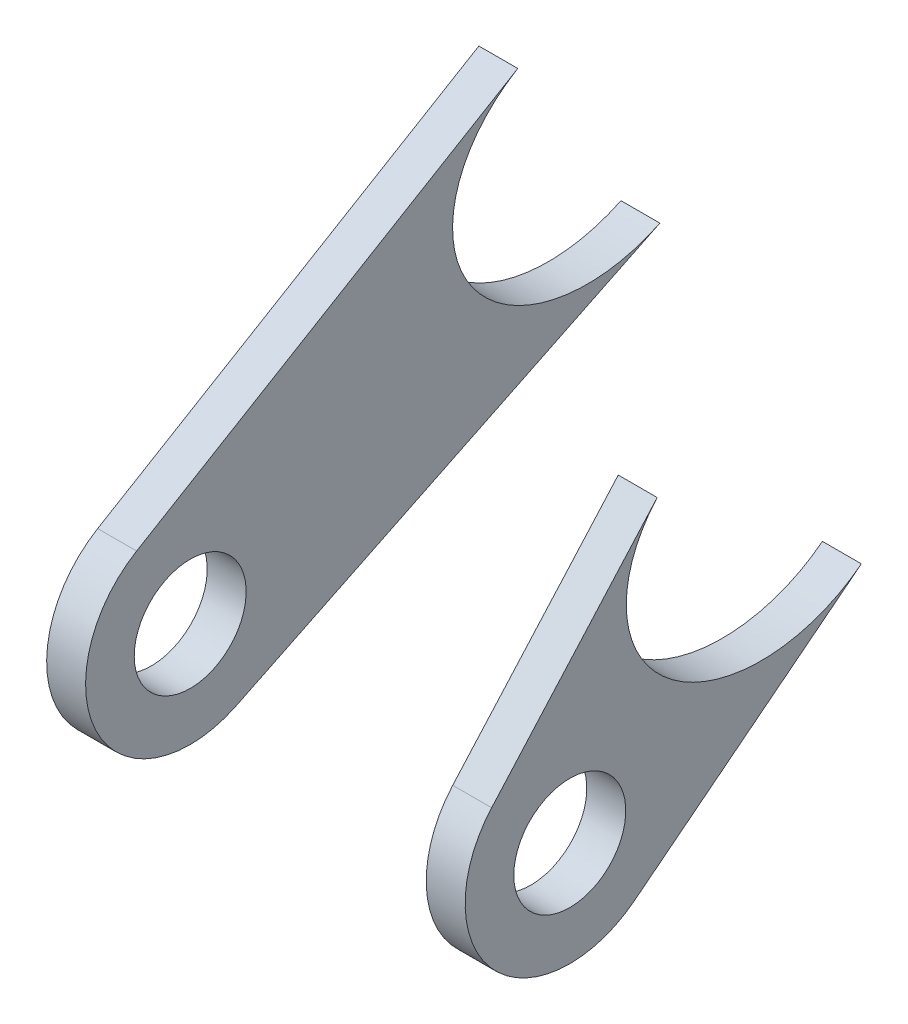
ISO-10303-21;
HEADER;
FILE_DESCRIPTION(('STEP AP214'),'2;1');
FILE_NAME('part.step','',(''),(''),'','','');
FILE_SCHEMA(('AUTOMOTIVE_DESIGN { 1 0 10303 214 1 1 1 1 }'));
ENDSEC;
DATA;
#1=APPLICATION_CONTEXT('core data for automotive mechanical design processes');
#2=APPLICATION_PROTOCOL_DEFINITION('international standard','automotive_design',2000,#1);
#3=PRODUCT_CONTEXT('',#1,'mechanical');
#4=PRODUCT('Part','Part','',(#3));
#5=PRODUCT_RELATED_PRODUCT_CATEGORY('part','',(#4));
#6=PRODUCT_DEFINITION_FORMATION('','',#4);
#7=PRODUCT_DEFINITION_CONTEXT('part definition',#1,'design');
#8=PRODUCT_DEFINITION('design','',#6,#7);
#9=PRODUCT_DEFINITION_SHAPE('','',#8);
#10=(LENGTH_UNIT() NAMED_UNIT(*) SI_UNIT(.MILLI.,.METRE.));
#11=(NAMED_UNIT(*) PLANE_ANGLE_UNIT() SI_UNIT($,.RADIAN.));
#12=(NAMED_UNIT(*) SI_UNIT($,.STERADIAN.) SOLID_ANGLE_UNIT());
#13=UNCERTAINTY_MEASURE_WITH_UNIT(LENGTH_MEASURE(1.E-05),#10,'distance_accuracy_value','');
#14=(GEOMETRIC_REPRESENTATION_CONTEXT(3) GLOBAL_UNCERTAINTY_ASSIGNED_CONTEXT((#13)) GLOBAL_UNIT_ASSIGNED_CONTEXT((#10,
#11,#12)) REPRESENTATION_CONTEXT('',''));
#15=CARTESIAN_POINT('',(0.,0.,0.));
#16=DIRECTION('',(0.,0.,1.));
#17=DIRECTION('',(1.,0.,0.));
#18=AXIS2_PLACEMENT_3D('',#15,#16,#17);
#19=CARTESIAN_POINT('',(10.3146290873709,143.374441874379,161.006531885884));
#20=DIRECTION('',(-1.57760826096266E-08,0.665030851347808,0.746815885446747));
#21=DIRECTION('',(0.,-0.746815885446747,0.665030851347808));
#22=AXIS2_PLACEMENT_3D('',#19,#20,#21);
#23=PLANE('',#22);
#24=DIRECTION('',(2.07258740079389E-08,0.746815885446748,-0.665030851347808));
#25=VECTOR('',#24,1.);
#26=CARTESIAN_POINT('',(6.31462908737091,143.374441894326,161.006531783623));
#27=LINE('',#26,#25);
#28=CARTESIAN_POINT('',(6.31461785346862,-261.417012490151,521.468609215989));
#29=VERTEX_POINT('',#28);
#30=CARTESIAN_POINT('',(6.31461838357811,-242.315565556028,504.458993105619));
#31=VERTEX_POINT('',#30);
#32=EDGE_CURVE('E127',#29,#31,#27,.T.);
#33=ORIENTED_EDGE('',*,*,#32,.F.);
#34=DIRECTION('',(-1.,4.98683030140527E-09,-2.55651747405935E-08));
#35=VECTOR('',#34,1.);
#36=CARTESIAN_POINT('',(10.3146178534686,-261.417012510098,521.468609318249));
#37=LINE('',#36,#35);
#38=CARTESIAN_POINT('',(10.3146178534686,-261.417012510098,521.468609318249));
#39=VERTEX_POINT('',#38);
#40=EDGE_CURVE('E12',#39,#29,#37,.T.);
#41=ORIENTED_EDGE('',*,*,#40,.F.);
#42=DIRECTION('',(2.07258740079389E-08,0.746815885446748,-0.665030851347808));
#43=VECTOR('',#42,1.);
#44=CARTESIAN_POINT('',(10.3146290873709,143.374441874379,161.006531885884));
#45=LINE('',#44,#43);
#46=CARTESIAN_POINT('',(10.3146183835781,-242.315565575976,504.45899320788));
#47=VERTEX_POINT('',#46);
#48=EDGE_CURVE('E105',#39,#47,#45,.T.);
#49=ORIENTED_EDGE('',*,*,#48,.T.);
#50=DIRECTION('',(-1.,4.98683030140527E-09,-2.55651747405935E-08));
#51=VECTOR('',#50,1.);
#52=CARTESIAN_POINT('',(10.3146183835781,-242.315565575976,504.45899320788));
#53=LINE('',#52,#51);
#54=EDGE_CURVE('E50',#47,#31,#53,.T.);
#55=ORIENTED_EDGE('',*,*,#54,.T.);
#56=EDGE_LOOP('',(#33,#41,#49,#55));
#57=FACE_BOUND('',#56,.T.);
#58=ADVANCED_FACE('F46',(#57),#23,.T.);
#59=CARTESIAN_POINT('',(10.3146180230615,-268.566094162037,513.440338549652));
#60=DIRECTION('',(-1.,4.98683030140527E-09,-2.55651747405935E-08));
#61=DIRECTION('',(-2.55651747405935E-08,0.,1.));
#62=AXIS2_PLACEMENT_3D('',#59,#60,#61);
#63=CYLINDRICAL_SURFACE('',#62,10.7499999999999);
#64=CARTESIAN_POINT('',(6.31461802306151,-268.56609414209,513.440338447392));
#65=DIRECTION('',(-1.,4.98683030433046E-09,-2.55651747346469E-08));
#66=DIRECTION('',(-2.55651747346469E-08,0.,1.));
#67=AXIS2_PLACEMENT_3D('',#64,#65,#66);
#68=CIRCLE('',#67,10.7499999999999);
#69=CARTESIAN_POINT('',(6.31461815066465,-277.019995954462,506.800003806218));
#70=VERTEX_POINT('',#69);
#71=EDGE_CURVE('E133',#70,#29,#68,.T.);
#72=ORIENTED_EDGE('',*,*,#71,.F.);
#73=DIRECTION('',(-1.,4.98683030140527E-09,-2.55651747405935E-08));
#74=VECTOR('',#73,1.);
#75=CARTESIAN_POINT('',(10.3146181506647,-277.019995974409,506.800003908478));
#76=LINE('',#75,#74);
#77=CARTESIAN_POINT('',(10.3146181506647,-277.019995974409,506.800003908478));
#78=VERTEX_POINT('',#77);
#79=EDGE_CURVE('E56',#78,#70,#76,.T.);
#80=ORIENTED_EDGE('',*,*,#79,.F.);
#81=CARTESIAN_POINT('',(10.3146180230615,-268.566094162037,513.440338549652));
#82=DIRECTION('',(-1.,4.98683030433046E-09,-2.55651747346469E-08));
#83=DIRECTION('',(-2.55651747346469E-08,0.,1.));
#84=AXIS2_PLACEMENT_3D('',#81,#82,#83);
#85=CIRCLE('',#84,10.7499999999999);
#86=EDGE_CURVE('E98',#78,#39,#85,.T.);
#87=ORIENTED_EDGE('',*,*,#86,.T.);
#88=ORIENTED_EDGE('',*,*,#40,.T.);
#89=EDGE_LOOP('',(#72,#80,#87,#88));
#90=FACE_BOUND('',#89,.T.);
#91=ADVANCED_FACE('F122',(#90),#63,.T.);
#92=CARTESIAN_POINT('',(10.3146313584933,74.867774510086,58.8068196464193));
#93=DIRECTION('',(-1.18700596950814E-08,0.786409470899636,0.617705548039965));
#94=DIRECTION('',(0.,-0.617705548039965,0.786409470899636));
#95=AXIS2_PLACEMENT_3D('',#92,#93,#94);
#96=PLANE('',#95);
#97=DIRECTION('',(2.31850882826492E-08,0.617705548039965,-0.786409470899636));
#98=VECTOR('',#97,1.);
#99=CARTESIAN_POINT('',(6.31463135849329,74.8677745300334,58.8068195441586));
#100=LINE('',#99,#98);
#101=CARTESIAN_POINT('',(6.31461883810034,-258.705084692557,483.483037136984));
#102=VERTEX_POINT('',#101);
#103=EDGE_CURVE('E102',#70,#102,#100,.T.);
#104=ORIENTED_EDGE('',*,*,#103,.T.);
#105=DIRECTION('',(-1.,4.98683030140527E-09,-2.55651747405935E-08));
#106=VECTOR('',#105,1.);
#107=CARTESIAN_POINT('',(10.3146188381003,-258.705084712504,483.483037239244));
#108=LINE('',#107,#106);
#109=CARTESIAN_POINT('',(10.3146188381003,-258.705084712504,483.483037239244));
#110=VERTEX_POINT('',#109);
#111=EDGE_CURVE('E100',#110,#102,#108,.T.);
#112=ORIENTED_EDGE('',*,*,#111,.F.);
#113=DIRECTION('',(2.31850882826492E-08,0.617705548039965,-0.786409470899636));
#114=VECTOR('',#113,1.);
#115=CARTESIAN_POINT('',(10.3146313584933,74.867774510086,58.8068196464193));
#116=LINE('',#115,#114);
#117=EDGE_CURVE('E94',#78,#110,#116,.T.);
#118=ORIENTED_EDGE('',*,*,#117,.F.);
#119=ORIENTED_EDGE('',*,*,#79,.T.);
#120=EDGE_LOOP('',(#104,#112,#118,#119));
#121=FACE_BOUND('',#120,.T.);
#122=ADVANCED_FACE('F101',(#121),#96,.F.);
#123=CARTESIAN_POINT('',(10.3146180230615,-268.566094162037,513.440338549652));
#124=DIRECTION('',(-1.,4.98683030140527E-09,-2.55651747405935E-08));
#125=DIRECTION('',(-2.55651747405935E-08,0.,1.));
#126=AXIS2_PLACEMENT_3D('',#123,#124,#125);
#127=CYLINDRICAL_SURFACE('',#126,5.75000000000009);
#128=CARTESIAN_POINT('',(10.3146180230615,-268.566094162037,513.440338549652));
#129=DIRECTION('',(-1.,4.98683030433046E-09,-2.55651747346469E-08));
#130=DIRECTION('',(-2.55651747346469E-08,0.,1.));
#131=AXIS2_PLACEMENT_3D('',#128,#129,#130);
#132=CIRCLE('',#131,5.75000000000009);
#133=CARTESIAN_POINT('',(10.3146178760618,-268.566094162037,519.190338549652));
#134=VERTEX_POINT('',#133);
#135=EDGE_CURVE('E107',#134,#134,#132,.T.);
#136=ORIENTED_EDGE('',*,*,#135,.F.);
#137=EDGE_LOOP('',(#136));
#138=FACE_BOUND('',#137,.T.);
#139=CARTESIAN_POINT('',(6.31461802306151,-268.56609414209,513.440338447392));
#140=DIRECTION('',(-1.,4.98683030433046E-09,-2.55651747346469E-08));
#141=DIRECTION('',(-2.55651747346469E-08,0.,1.));
#142=AXIS2_PLACEMENT_3D('',#139,#140,#141);
#143=CIRCLE('',#142,5.75000000000009);
#144=CARTESIAN_POINT('',(6.31461787606176,-268.56609414209,519.190338447392));
#145=VERTEX_POINT('',#144);
#146=EDGE_CURVE('E131',#145,#145,#143,.T.);
#147=ORIENTED_EDGE('',*,*,#146,.T.);
#148=EDGE_LOOP('',(#147));
#149=FACE_BOUND('',#148,.T.);
#150=ADVANCED_FACE('F48',(#138,#149),#127,.F.);
#151=CARTESIAN_POINT('',(10.3146190208779,-247.270967496749,478.563939057839));
#152=CARTESIAN_POINT('',(10.314619041143,-222.596362513706,482.58437049374));
#153=CARTESIAN_POINT('',(10.3146182779649,-227.310596313551,511.517050645969));
#154=CARTESIAN_POINT('',(10.3146182576998,-251.985201296594,507.496619210067));
#155=CARTESIAN_POINT('',(10.3146182374348,-276.659806279637,503.476187774166));
#156=CARTESIAN_POINT('',(10.3146190006129,-271.945572479792,474.543507621938));
#157=CARTESIAN_POINT('',(10.3146190208779,-247.270967496749,478.563939057839));
#158=(BOUNDED_CURVE() B_SPLINE_CURVE(3,(#151,#152,#153,#154,#155,#156,#157),.UNSPECIFIED.,.T.,
.F.) B_SPLINE_CURVE_WITH_KNOTS((4,3,4),(0.,0.5,1.),
.UNSPECIFIED.) CURVE() GEOMETRIC_REPRESENTATION_ITEM() RATIONAL_B_SPLINE_CURVE((1.,
0.333333333333333,0.333333333333333,1.,0.333333333333333,0.333333333333333,1.)) REPRESENTATION_ITEM(''));
#159=DIRECTION('',(-1.,4.98683030140527E-09,-2.55651747405935E-08));
#160=VECTOR('',#159,1.);
#161=SURFACE_OF_LINEAR_EXTRUSION('',#158,#160);
#162=CARTESIAN_POINT('',(6.31461902087794,-247.270967476802,478.563938955578));
#163=CARTESIAN_POINT('',(6.31461904114297,-222.596362493758,482.58437039148));
#164=CARTESIAN_POINT('',(6.31461827796487,-227.310596293604,511.517050543708));
#165=CARTESIAN_POINT('',(6.31461825769983,-251.985201276647,507.496619107807));
#166=CARTESIAN_POINT('',(6.3146182374348,-276.65980625969,503.476187671906));
#167=CARTESIAN_POINT('',(6.3146190006129,-271.945572459845,474.543507519677));
#168=CARTESIAN_POINT('',(6.31461902087794,-247.270967476802,478.563938955578));
#169=(BOUNDED_CURVE() B_SPLINE_CURVE(3,(#162,#163,#164,#165,#166,#167,#168),.UNSPECIFIED.,.T.,
.F.) B_SPLINE_CURVE_WITH_KNOTS((4,3,4),(0.,0.5,1.),
.UNSPECIFIED.) CURVE() GEOMETRIC_REPRESENTATION_ITEM() RATIONAL_B_SPLINE_CURVE((1.,
0.333333333333333,0.333333333333333,1.,0.333333333333333,0.333333333333333,1.)) REPRESENTATION_ITEM(''));
#170=EDGE_CURVE('E130',#31,#102,#169,.T.);
#171=ORIENTED_EDGE('',*,*,#170,.F.);
#172=ORIENTED_EDGE('',*,*,#54,.F.);
#173=EDGE_CURVE('E97',#47,#110,#158,.T.);
#174=ORIENTED_EDGE('',*,*,#173,.T.);
#175=ORIENTED_EDGE('',*,*,#111,.T.);
#176=EDGE_LOOP('',(#171,#172,#174,#175));
#177=FACE_BOUND('',#176,.T.);
#178=ADVANCED_FACE('F104',(#177),#161,.T.);
#179=CARTESIAN_POINT('',(10.314632488547,-5.1437321860217E-08,2.63695381917157E-07));
#180=DIRECTION('',(-1.,4.98683030433046E-09,-2.55651747346469E-08));
#181=DIRECTION('',(-2.55651747346469E-08,0.,1.));
#182=AXIS2_PLACEMENT_3D('',#179,#180,#181);
#183=PLANE('',#182);
#184=ORIENTED_EDGE('',*,*,#135,.T.);
#185=EDGE_LOOP('',(#184));
#186=FACE_BOUND('',#185,.T.);
#187=ORIENTED_EDGE('',*,*,#48,.F.);
#188=ORIENTED_EDGE('',*,*,#86,.F.);
#189=ORIENTED_EDGE('',*,*,#117,.T.);
#190=ORIENTED_EDGE('',*,*,#173,.F.);
#191=EDGE_LOOP('',(#187,#188,#189,#190));
#192=FACE_BOUND('',#191,.T.);
#193=ADVANCED_FACE('F96',(#186,#192),#183,.F.);
#194=CARTESIAN_POINT('',(6.31463248854701,-3.14900006545959E-08,1.61434682954783E-07));
#195=DIRECTION('',(-1.,4.98683030433046E-09,-2.55651747346469E-08));
#196=DIRECTION('',(-2.55651747346469E-08,0.,1.));
#197=AXIS2_PLACEMENT_3D('',#194,#195,#196);
#198=PLANE('',#197);
#199=ORIENTED_EDGE('',*,*,#146,.F.);
#200=EDGE_LOOP('',(#199));
#201=FACE_BOUND('',#200,.T.);
#202=ORIENTED_EDGE('',*,*,#32,.T.);
#203=ORIENTED_EDGE('',*,*,#170,.T.);
#204=ORIENTED_EDGE('',*,*,#103,.F.);
#205=ORIENTED_EDGE('',*,*,#71,.T.);
#206=EDGE_LOOP('',(#202,#203,#204,#205));
#207=FACE_BOUND('',#206,.T.);
#208=ADVANCED_FACE('F134',(#201,#207),#198,.T.);
#209=CLOSED_SHELL('',(#58,#91,#122,#150,#178,#193,#208));
#210=MANIFOLD_SOLID_BREP('B2',#209);
#211=CARTESIAN_POINT('',(-32.685367890936,36.9896296930034,22.0590699883855));
#212=DIRECTION('',(8.81129300600473E-09,-0.85886974750775,-0.51219406167582));
#213=DIRECTION('',(0.,0.51219406167582,-0.85886974750775));
#214=AXIS2_PLACEMENT_3D('',#211,#212,#213);
#215=PLANE('',#214);
#216=DIRECTION('',(2.451138004461E-08,0.51219406167582,-0.85886974750775));
#217=VECTOR('',#216,1.);
#218=CARTESIAN_POINT('',(-28.685367890936,36.9896296730561,22.0590700906462));
#219=LINE('',#218,#217);
#220=CARTESIAN_POINT('',(-28.6853820716599,-259.333244181995,518.946423715882));
#221=VERTEX_POINT('',#220);
#222=CARTESIAN_POINT('',(-28.6853809539655,-235.977708006868,479.782823513239));
#223=VERTEX_POINT('',#222);
#224=EDGE_CURVE('E270',#221,#223,#219,.T.);
#225=ORIENTED_EDGE('',*,*,#224,.T.);
#226=DIRECTION('',(1.,-4.98683030140527E-09,2.55651747405935E-08));
#227=VECTOR('',#226,1.);
#228=CARTESIAN_POINT('',(-32.6853809539655,-235.977707986921,479.782823410978));
#229=LINE('',#228,#227);
#230=CARTESIAN_POINT('',(-32.6853809539655,-235.977707986921,479.782823410978));
#231=VERTEX_POINT('',#230);
#232=EDGE_CURVE('E44',#231,#223,#229,.T.);
#233=ORIENTED_EDGE('',*,*,#232,.F.);
#234=DIRECTION('',(2.451138004461E-08,0.51219406167582,-0.85886974750775));
#235=VECTOR('',#234,1.);
#236=CARTESIAN_POINT('',(-32.685367890936,36.9896296930034,22.0590699883855));
#237=LINE('',#236,#235);
#238=CARTESIAN_POINT('',(-32.6853820716599,-259.333244162048,518.946423613621));
#239=VERTEX_POINT('',#238);
#240=EDGE_CURVE('E249',#239,#231,#237,.T.);
#241=ORIENTED_EDGE('',*,*,#240,.F.);
#242=DIRECTION('',(1.,-4.98683030140527E-09,2.55651747405935E-08));
#243=VECTOR('',#242,1.);
#244=CARTESIAN_POINT('',(-32.6853820716599,-259.333244162048,518.946423613621));
#245=LINE('',#244,#243);
#246=EDGE_CURVE('E260',#239,#221,#245,.T.);
#247=ORIENTED_EDGE('',*,*,#246,.T.);
#248=EDGE_LOOP('',(#225,#233,#241,#247));
#249=FACE_BOUND('',#248,.T.);
#250=ADVANCED_FACE('F201',(#249),#215,.F.);
#251=CARTESIAN_POINT('',(-32.6853804211867,-243.82454050635,457.412173364182));
#252=CARTESIAN_POINT('',(-32.6853804009217,-219.149935523307,461.432604800083));
#253=CARTESIAN_POINT('',(-32.6853811640998,-223.864169323152,490.365284952312));
#254=CARTESIAN_POINT('',(-32.6853811843649,-248.538774306195,486.34485351641));
#255=CARTESIAN_POINT('',(-32.6853812046299,-273.213379289238,482.324422080509));
#256=CARTESIAN_POINT('',(-32.6853804414518,-268.499145489393,453.391741928281));
#257=CARTESIAN_POINT('',(-32.6853804211867,-243.82454050635,457.412173364182));
#258=(BOUNDED_CURVE() B_SPLINE_CURVE(3,(#251,#252,#253,#254,#255,#256,#257),.UNSPECIFIED.,.T.,
.F.) B_SPLINE_CURVE_WITH_KNOTS((4,3,4),(0.,0.5,1.),
.UNSPECIFIED.) CURVE() GEOMETRIC_REPRESENTATION_ITEM() RATIONAL_B_SPLINE_CURVE((1.,
0.333333333333333,0.333333333333333,1.,0.333333333333333,0.333333333333333,1.)) REPRESENTATION_ITEM(''));
#259=DIRECTION('',(1.,-4.98683030140527E-09,2.55651747405935E-08));
#260=VECTOR('',#259,1.);
#261=SURFACE_OF_LINEAR_EXTRUSION('',#258,#260);
#262=CARTESIAN_POINT('',(-28.6853804211867,-243.824540526297,457.412173466443));
#263=CARTESIAN_POINT('',(-28.6853804009217,-219.149935543254,461.432604902344));
#264=CARTESIAN_POINT('',(-28.6853811640998,-223.864169343099,490.365285054572));
#265=CARTESIAN_POINT('',(-28.6853811843649,-248.538774326142,486.344853618671));
#266=CARTESIAN_POINT('',(-28.6853812046299,-273.213379309186,482.32442218277));
#267=CARTESIAN_POINT('',(-28.6853804414518,-268.49914550934,453.391742030542));
#268=CARTESIAN_POINT('',(-28.6853804211867,-243.824540526297,457.412173466443));
#269=(BOUNDED_CURVE() B_SPLINE_CURVE(3,(#262,#263,#264,#265,#266,#267,#268),.UNSPECIFIED.,.T.,
.F.) B_SPLINE_CURVE_WITH_KNOTS((4,3,4),(0.,0.5,1.),
.UNSPECIFIED.) CURVE() GEOMETRIC_REPRESENTATION_ITEM() RATIONAL_B_SPLINE_CURVE((1.,
0.333333333333333,0.333333333333333,1.,0.333333333333333,0.333333333333333,1.)) REPRESENTATION_ITEM(''));
#270=CARTESIAN_POINT('',(-28.685380685745,-257.038339252239,465.183030214717));
#271=VERTEX_POINT('',#270);
#272=EDGE_CURVE('E254',#223,#271,#269,.T.);
#273=ORIENTED_EDGE('',*,*,#272,.T.);
#274=DIRECTION('',(1.,-4.98683030140527E-09,2.55651747405935E-08));
#275=VECTOR('',#274,1.);
#276=CARTESIAN_POINT('',(-32.685380685745,-257.038339232291,465.183030112456));
#277=LINE('',#276,#275);
#278=CARTESIAN_POINT('',(-32.685380685745,-257.038339232291,465.183030112456));
#279=VERTEX_POINT('',#278);
#280=EDGE_CURVE('E210',#279,#271,#277,.T.);
#281=ORIENTED_EDGE('',*,*,#280,.F.);
#282=EDGE_CURVE('E244',#231,#279,#258,.T.);
#283=ORIENTED_EDGE('',*,*,#282,.F.);
#284=ORIENTED_EDGE('',*,*,#232,.T.);
#285=EDGE_LOOP('',(#273,#281,#283,#284));
#286=FACE_BOUND('',#285,.T.);
#287=ADVANCED_FACE('F253',(#286),#261,.F.);
#288=CARTESIAN_POINT('',(-32.6853673266121,-24.7985220412367,-12.0674670765865));
#289=DIRECTION('',(6.70227974192378E-09,-0.899187722607375,-0.437563069182219));
#290=DIRECTION('',(0.,0.437563069182219,-0.899187722607375));
#291=AXIS2_PLACEMENT_3D('',#288,#289,#290);
#292=PLANE('',#291);
#293=DIRECTION('',(2.51699440269127E-08,0.437563069182219,-0.899187722607374));
#294=VECTOR('',#293,1.);
#295=CARTESIAN_POINT('',(-28.6853673266121,-24.798522061184,-12.0674669743258));
#296=LINE('',#295,#294);
#297=CARTESIAN_POINT('',(-28.685381904889,-278.232361985705,508.736534559158));
#298=VERTEX_POINT('',#297);
#299=EDGE_CURVE('E276',#298,#271,#296,.T.);
#300=ORIENTED_EDGE('',*,*,#299,.F.);
#301=DIRECTION('',(1.,-4.98683030140527E-09,2.55651747405935E-08));
#302=VECTOR('',#301,1.);
#303=CARTESIAN_POINT('',(-32.685381904889,-278.232361965758,508.736534456897));
#304=LINE('',#303,#302);
#305=CARTESIAN_POINT('',(-32.685381904889,-278.232361965758,508.736534456897));
#306=VERTEX_POINT('',#305);
#307=EDGE_CURVE('E234',#306,#298,#304,.T.);
#308=ORIENTED_EDGE('',*,*,#307,.F.);
#309=DIRECTION('',(2.51699440269127E-08,0.437563069182219,-0.899187722607374));
#310=VECTOR('',#309,1.);
#311=CARTESIAN_POINT('',(-32.6853673266121,-24.7985220412367,-12.0674670765865));
#312=LINE('',#311,#310);
#313=EDGE_CURVE('E247',#306,#279,#312,.T.);
#314=ORIENTED_EDGE('',*,*,#313,.T.);
#315=ORIENTED_EDGE('',*,*,#280,.T.);
#316=EDGE_LOOP('',(#300,#308,#314,#315));
#317=FACE_BOUND('',#316,.T.);
#318=ADVANCED_FACE('F258',(#317),#292,.T.);
#319=CARTESIAN_POINT('',(-32.6853819769385,-268.566093947604,513.44033745035));
#320=DIRECTION('',(1.,-4.98683030140527E-09,2.55651747405935E-08));
#321=DIRECTION('',(2.55651747405935E-08,0.,-1.));
#322=AXIS2_PLACEMENT_3D('',#319,#320,#321);
#323=CYLINDRICAL_SURFACE('',#322,5.75000000000009);
#324=CARTESIAN_POINT('',(-32.6853819769385,-268.566093947604,513.44033745035));
#325=DIRECTION('',(-1.,4.98683031828182E-09,-2.5565174734255E-08));
#326=DIRECTION('',(-2.5565174734255E-08,0.,1.));
#327=AXIS2_PLACEMENT_3D('',#324,#325,#326);
#328=CIRCLE('',#327,5.75000000000009);
#329=CARTESIAN_POINT('',(-32.6853821239382,-268.566093947604,519.19033745035));
#330=VERTEX_POINT('',#329);
#331=EDGE_CURVE('E282',#330,#330,#328,.T.);
#332=ORIENTED_EDGE('',*,*,#331,.T.);
#333=EDGE_LOOP('',(#332));
#334=FACE_BOUND('',#333,.T.);
#335=CARTESIAN_POINT('',(-28.6853819769385,-268.566093967551,513.440337552611));
#336=DIRECTION('',(-1.,4.98683031828182E-09,-2.5565174734255E-08));
#337=DIRECTION('',(-2.5565174734255E-08,0.,1.));
#338=AXIS2_PLACEMENT_3D('',#335,#336,#337);
#339=CIRCLE('',#338,5.75000000000009);
#340=CARTESIAN_POINT('',(-28.6853821239382,-268.566093967551,519.190337552611));
#341=VERTEX_POINT('',#340);
#342=EDGE_CURVE('E267',#341,#341,#339,.T.);
#343=ORIENTED_EDGE('',*,*,#342,.F.);
#344=EDGE_LOOP('',(#343));
#345=FACE_BOUND('',#344,.T.);
#346=ADVANCED_FACE('F203',(#334,#345),#323,.F.);
#347=CARTESIAN_POINT('',(-32.6853819769385,-268.566093947604,513.44033745035));
#348=DIRECTION('',(1.,-4.98683030140527E-09,2.55651747405935E-08));
#349=DIRECTION('',(2.55651747405935E-08,0.,-1.));
#350=AXIS2_PLACEMENT_3D('',#347,#348,#349);
#351=CYLINDRICAL_SURFACE('',#350,10.7500000000001);
#352=CARTESIAN_POINT('',(-28.6853819769385,-268.566093967551,513.440337552611));
#353=DIRECTION('',(-1.,4.98683031828182E-09,-2.5565174734255E-08));
#354=DIRECTION('',(-2.5565174734255E-08,0.,1.));
#355=AXIS2_PLACEMENT_3D('',#352,#353,#354);
#356=CIRCLE('',#355,10.7500000000001);
#357=EDGE_CURVE('E237',#298,#221,#356,.T.);
#358=ORIENTED_EDGE('',*,*,#357,.T.);
#359=ORIENTED_EDGE('',*,*,#246,.F.);
#360=CARTESIAN_POINT('',(-32.6853819769385,-268.566093947604,513.44033745035));
#361=DIRECTION('',(-1.,4.98683031828182E-09,-2.5565174734255E-08));
#362=DIRECTION('',(-2.5565174734255E-08,0.,1.));
#363=AXIS2_PLACEMENT_3D('',#360,#361,#362);
#364=CIRCLE('',#363,10.7500000000001);
#365=EDGE_CURVE('E218',#306,#239,#364,.T.);
#366=ORIENTED_EDGE('',*,*,#365,.F.);
#367=ORIENTED_EDGE('',*,*,#307,.T.);
#368=EDGE_LOOP('',(#358,#359,#366,#367));
#369=FACE_BOUND('',#368,.T.);
#370=ADVANCED_FACE('F294',(#369),#351,.T.);
#371=CARTESIAN_POINT('',(-32.685367511453,1.62996381602791E-07,-8.35607131708992E-07));
#372=DIRECTION('',(-1.,4.98683031828182E-09,-2.5565174734255E-08));
#373=DIRECTION('',(-2.5565174734255E-08,0.,1.));
#374=AXIS2_PLACEMENT_3D('',#371,#372,#373);
#375=PLANE('',#374);
#376=ORIENTED_EDGE('',*,*,#331,.F.);
#377=EDGE_LOOP('',(#376));
#378=FACE_BOUND('',#377,.T.);
#379=ORIENTED_EDGE('',*,*,#240,.T.);
#380=ORIENTED_EDGE('',*,*,#282,.T.);
#381=ORIENTED_EDGE('',*,*,#313,.F.);
#382=ORIENTED_EDGE('',*,*,#365,.T.);
#383=EDGE_LOOP('',(#379,#380,#381,#382));
#384=FACE_BOUND('',#383,.T.);
#385=ADVANCED_FACE('F245',(#378,#384),#375,.T.);
#386=CARTESIAN_POINT('',(-28.685367511453,1.4304906039717E-07,-7.33346432746618E-07));
#387=DIRECTION('',(-1.,4.98683031828182E-09,-2.5565174734255E-08));
#388=DIRECTION('',(-2.5565174734255E-08,0.,1.));
#389=AXIS2_PLACEMENT_3D('',#386,#387,#388);
#390=PLANE('',#389);
#391=ORIENTED_EDGE('',*,*,#342,.T.);
#392=EDGE_LOOP('',(#391));
#393=FACE_BOUND('',#392,.T.);
#394=ORIENTED_EDGE('',*,*,#224,.F.);
#395=ORIENTED_EDGE('',*,*,#357,.F.);
#396=ORIENTED_EDGE('',*,*,#299,.T.);
#397=ORIENTED_EDGE('',*,*,#272,.F.);
#398=EDGE_LOOP('',(#394,#395,#396,#397));
#399=FACE_BOUND('',#398,.T.);
#400=ADVANCED_FACE('F287',(#393,#399),#390,.F.);
#401=CLOSED_SHELL('',(#250,#287,#318,#346,#370,#385,#400));
#402=MANIFOLD_SOLID_BREP('B6',#401);
#403=ADVANCED_BREP_SHAPE_REPRESENTATION('',(#18,#210,#402),#14);
#404=SHAPE_DEFINITION_REPRESENTATION(#9,#403);
ENDSEC;
END-ISO-10303-21;
